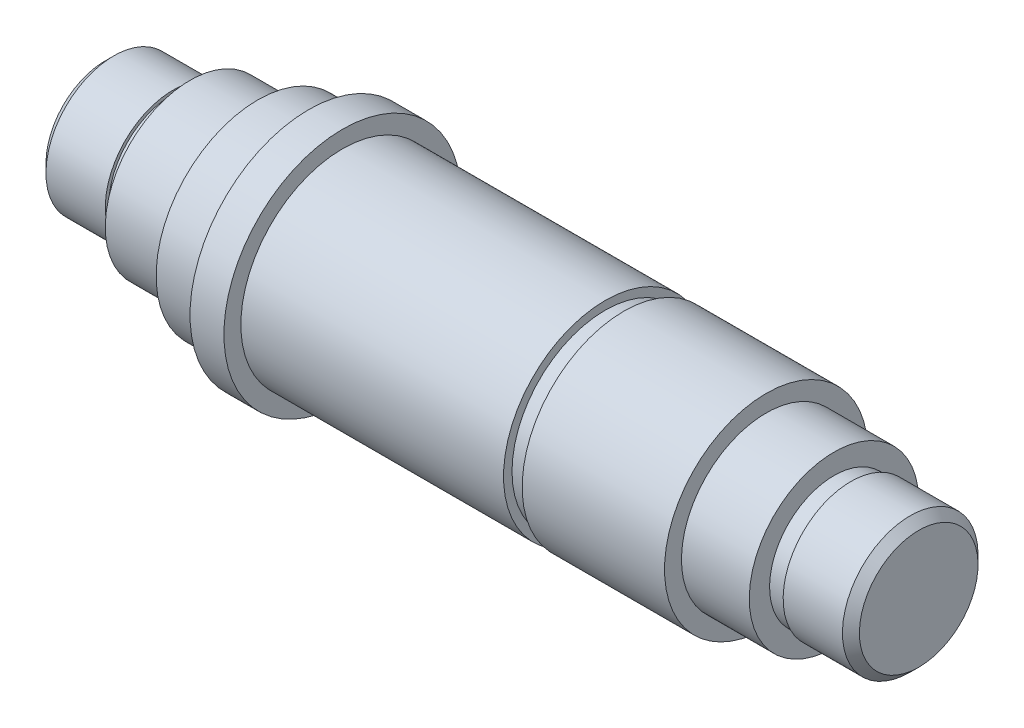
ISO-10303-21;
HEADER;
FILE_DESCRIPTION(('STEP AP214'),'2;1');
FILE_NAME('part.step','',(''),(''),'','','');
FILE_SCHEMA(('AUTOMOTIVE_DESIGN { 1 0 10303 214 1 1 1 1 }'));
ENDSEC;
DATA;
#1=APPLICATION_CONTEXT('core data for automotive mechanical design processes');
#2=APPLICATION_PROTOCOL_DEFINITION('international standard','automotive_design',2000,#1);
#3=PRODUCT_CONTEXT('',#1,'mechanical');
#4=PRODUCT('Part','Part','',(#3));
#5=PRODUCT_RELATED_PRODUCT_CATEGORY('part','',(#4));
#6=PRODUCT_DEFINITION_FORMATION('','',#4);
#7=PRODUCT_DEFINITION_CONTEXT('part definition',#1,'design');
#8=PRODUCT_DEFINITION('design','',#6,#7);
#9=PRODUCT_DEFINITION_SHAPE('','',#8);
#10=(LENGTH_UNIT() NAMED_UNIT(*) SI_UNIT(.MILLI.,.METRE.));
#11=(NAMED_UNIT(*) PLANE_ANGLE_UNIT() SI_UNIT($,.RADIAN.));
#12=(NAMED_UNIT(*) SI_UNIT($,.STERADIAN.) SOLID_ANGLE_UNIT());
#13=UNCERTAINTY_MEASURE_WITH_UNIT(LENGTH_MEASURE(1.E-05),#10,'distance_accuracy_value','');
#14=(GEOMETRIC_REPRESENTATION_CONTEXT(3) GLOBAL_UNCERTAINTY_ASSIGNED_CONTEXT((#13)) GLOBAL_UNIT_ASSIGNED_CONTEXT((#10,
#11,#12)) REPRESENTATION_CONTEXT('',''));
#15=CARTESIAN_POINT('',(0.,0.,0.));
#16=DIRECTION('',(0.,0.,1.));
#17=DIRECTION('',(1.,0.,0.));
#18=AXIS2_PLACEMENT_3D('',#15,#16,#17);
#19=CARTESIAN_POINT('',(-10.7643979057592,3.5,0.));
#20=DIRECTION('',(1.,0.,0.));
#21=DIRECTION('',(0.,1.,0.));
#22=AXIS2_PLACEMENT_3D('',#19,#20,#21);
#23=PLANE('',#22);
#24=CARTESIAN_POINT('',(-10.7643979057592,0.,0.));
#25=DIRECTION('',(-1.,0.,0.));
#26=DIRECTION('',(0.,-1.,0.));
#27=AXIS2_PLACEMENT_3D('',#24,#25,#26);
#28=CIRCLE('',#27,3.5);
#29=CARTESIAN_POINT('',(-10.7643979057592,-3.5,0.));
#30=VERTEX_POINT('',#29);
#31=EDGE_CURVE('E597',#30,#30,#28,.T.);
#32=ORIENTED_EDGE('',*,*,#31,.T.);
#33=EDGE_LOOP('',(#32));
#34=FACE_BOUND('',#33,.T.);
#35=ADVANCED_FACE('F521',(#34),#23,.F.);
#36=CARTESIAN_POINT('',(37.2356020942408,3.50000000000001,0.));
#37=DIRECTION('',(-1.,0.,0.));
#38=DIRECTION('',(0.,-1.,0.));
#39=AXIS2_PLACEMENT_3D('',#36,#37,#38);
#40=PLANE('',#39);
#41=CARTESIAN_POINT('',(37.2356020942408,0.,0.));
#42=DIRECTION('',(-1.,0.,0.));
#43=DIRECTION('',(0.,-1.,0.));
#44=AXIS2_PLACEMENT_3D('',#41,#42,#43);
#45=CIRCLE('',#44,3.50000000000001);
#46=CARTESIAN_POINT('',(37.2356020942408,-3.5,0.));
#47=VERTEX_POINT('',#46);
#48=EDGE_CURVE('E13',#47,#47,#45,.T.);
#49=ORIENTED_EDGE('',*,*,#48,.F.);
#50=EDGE_LOOP('',(#49));
#51=FACE_BOUND('',#50,.T.);
#52=ADVANCED_FACE('F735',(#51),#40,.F.);
#53=CARTESIAN_POINT('',(37.2356020942408,0.,0.));
#54=DIRECTION('',(-1.,0.,0.));
#55=DIRECTION('',(0.,-1.,0.));
#56=AXIS2_PLACEMENT_3D('',#53,#54,#55);
#57=CONICAL_SURFACE('',#56,3.50000000000001,0.785398163397445);
#58=CARTESIAN_POINT('',(36.7356020942408,0.,0.));
#59=DIRECTION('',(-1.,0.,0.));
#60=DIRECTION('',(0.,-1.,0.));
#61=AXIS2_PLACEMENT_3D('',#58,#59,#60);
#62=CIRCLE('',#61,4.);
#63=CARTESIAN_POINT('',(36.7356020942408,-4.,0.));
#64=VERTEX_POINT('',#63);
#65=EDGE_CURVE('E527',#64,#64,#62,.T.);
#66=ORIENTED_EDGE('',*,*,#65,.F.);
#67=EDGE_LOOP('',(#66));
#68=FACE_BOUND('',#67,.T.);
#69=ORIENTED_EDGE('',*,*,#48,.T.);
#70=EDGE_LOOP('',(#69));
#71=FACE_BOUND('',#70,.T.);
#72=ADVANCED_FACE('F730',(#68,#71),#57,.T.);
#73=CARTESIAN_POINT('',(-10.7643979057592,0.,0.));
#74=DIRECTION('',(-1.,0.,0.));
#75=DIRECTION('',(0.,-1.,0.));
#76=AXIS2_PLACEMENT_3D('',#73,#74,#75);
#77=CYLINDRICAL_SURFACE('',#76,4.);
#78=CARTESIAN_POINT('',(33.2356020942408,0.,0.));
#79=DIRECTION('',(-1.,0.,0.));
#80=DIRECTION('',(0.,-1.,0.));
#81=AXIS2_PLACEMENT_3D('',#78,#79,#80);
#82=CIRCLE('',#81,4.);
#83=CARTESIAN_POINT('',(33.2356020942408,-4.,0.));
#84=VERTEX_POINT('',#83);
#85=EDGE_CURVE('E531',#84,#84,#82,.T.);
#86=ORIENTED_EDGE('',*,*,#85,.F.);
#87=EDGE_LOOP('',(#86));
#88=FACE_BOUND('',#87,.T.);
#89=ORIENTED_EDGE('',*,*,#65,.T.);
#90=EDGE_LOOP('',(#89));
#91=FACE_BOUND('',#90,.T.);
#92=ADVANCED_FACE('F725',(#88,#91),#77,.T.);
#93=CARTESIAN_POINT('',(33.2356020942408,3.80000000000001,0.));
#94=DIRECTION('',(1.,0.,0.));
#95=DIRECTION('',(0.,1.,0.));
#96=AXIS2_PLACEMENT_3D('',#93,#94,#95);
#97=PLANE('',#96);
#98=CARTESIAN_POINT('',(33.2356020942408,0.,0.));
#99=DIRECTION('',(-1.,0.,0.));
#100=DIRECTION('',(0.,-1.,0.));
#101=AXIS2_PLACEMENT_3D('',#98,#99,#100);
#102=CIRCLE('',#101,3.8);
#103=CARTESIAN_POINT('',(33.2356020942408,-3.8,0.));
#104=VERTEX_POINT('',#103);
#105=EDGE_CURVE('E535',#104,#104,#102,.T.);
#106=ORIENTED_EDGE('',*,*,#105,.F.);
#107=EDGE_LOOP('',(#106));
#108=FACE_BOUND('',#107,.T.);
#109=ORIENTED_EDGE('',*,*,#85,.T.);
#110=EDGE_LOOP('',(#109));
#111=FACE_BOUND('',#110,.T.);
#112=ADVANCED_FACE('F719',(#108,#111),#97,.F.);
#113=CARTESIAN_POINT('',(-10.7643979057592,0.,0.));
#114=DIRECTION('',(-1.,0.,0.));
#115=DIRECTION('',(0.,-1.,0.));
#116=AXIS2_PLACEMENT_3D('',#113,#114,#115);
#117=CYLINDRICAL_SURFACE('',#116,3.8);
#118=CARTESIAN_POINT('',(32.2356020942408,0.,0.));
#119=DIRECTION('',(-1.,0.,0.));
#120=DIRECTION('',(0.,-1.,0.));
#121=AXIS2_PLACEMENT_3D('',#118,#119,#120);
#122=CIRCLE('',#121,3.8);
#123=CARTESIAN_POINT('',(32.2356020942408,-3.8,0.));
#124=VERTEX_POINT('',#123);
#125=EDGE_CURVE('E540',#124,#124,#122,.T.);
#126=ORIENTED_EDGE('',*,*,#125,.F.);
#127=EDGE_LOOP('',(#126));
#128=FACE_BOUND('',#127,.T.);
#129=ORIENTED_EDGE('',*,*,#105,.T.);
#130=EDGE_LOOP('',(#129));
#131=FACE_BOUND('',#130,.T.);
#132=ADVANCED_FACE('F713',(#128,#131),#117,.T.);
#133=CARTESIAN_POINT('',(32.2356020942408,5.00000000000001,0.));
#134=DIRECTION('',(-1.,0.,0.));
#135=DIRECTION('',(0.,-1.,0.));
#136=AXIS2_PLACEMENT_3D('',#133,#134,#135);
#137=PLANE('',#136);
#138=CARTESIAN_POINT('',(32.2356020942408,0.,0.));
#139=DIRECTION('',(-1.,0.,0.));
#140=DIRECTION('',(0.,-1.,0.));
#141=AXIS2_PLACEMENT_3D('',#138,#139,#140);
#142=CIRCLE('',#141,5.);
#143=CARTESIAN_POINT('',(32.2356020942408,-4.99999999999999,0.));
#144=VERTEX_POINT('',#143);
#145=EDGE_CURVE('E543',#144,#144,#142,.T.);
#146=ORIENTED_EDGE('',*,*,#145,.F.);
#147=EDGE_LOOP('',(#146));
#148=FACE_BOUND('',#147,.T.);
#149=ORIENTED_EDGE('',*,*,#125,.T.);
#150=EDGE_LOOP('',(#149));
#151=FACE_BOUND('',#150,.T.);
#152=ADVANCED_FACE('F707',(#148,#151),#137,.F.);
#153=CARTESIAN_POINT('',(-10.7643979057592,0.,0.));
#154=DIRECTION('',(-1.,0.,0.));
#155=DIRECTION('',(0.,-1.,0.));
#156=AXIS2_PLACEMENT_3D('',#153,#154,#155);
#157=CYLINDRICAL_SURFACE('',#156,5.);
#158=CARTESIAN_POINT('',(28.2356020942408,0.,0.));
#159=DIRECTION('',(-1.,0.,0.));
#160=DIRECTION('',(0.,-1.,0.));
#161=AXIS2_PLACEMENT_3D('',#158,#159,#160);
#162=CIRCLE('',#161,5.);
#163=CARTESIAN_POINT('',(28.2356020942408,-4.99999999999999,0.));
#164=VERTEX_POINT('',#163);
#165=EDGE_CURVE('E546',#164,#164,#162,.T.);
#166=ORIENTED_EDGE('',*,*,#165,.F.);
#167=EDGE_LOOP('',(#166));
#168=FACE_BOUND('',#167,.T.);
#169=ORIENTED_EDGE('',*,*,#145,.T.);
#170=EDGE_LOOP('',(#169));
#171=FACE_BOUND('',#170,.T.);
#172=ADVANCED_FACE('F701',(#168,#171),#157,.T.);
#173=CARTESIAN_POINT('',(28.2356020942408,6.,0.));
#174=DIRECTION('',(-1.,0.,0.));
#175=DIRECTION('',(0.,-1.,0.));
#176=AXIS2_PLACEMENT_3D('',#173,#174,#175);
#177=PLANE('',#176);
#178=CARTESIAN_POINT('',(28.2356020942408,0.,0.));
#179=DIRECTION('',(-1.,0.,0.));
#180=DIRECTION('',(0.,-1.,0.));
#181=AXIS2_PLACEMENT_3D('',#178,#179,#180);
#182=CIRCLE('',#181,6.);
#183=CARTESIAN_POINT('',(28.2356020942408,-5.99999999999999,0.));
#184=VERTEX_POINT('',#183);
#185=EDGE_CURVE('E549',#184,#184,#182,.T.);
#186=ORIENTED_EDGE('',*,*,#185,.F.);
#187=EDGE_LOOP('',(#186));
#188=FACE_BOUND('',#187,.T.);
#189=ORIENTED_EDGE('',*,*,#165,.T.);
#190=EDGE_LOOP('',(#189));
#191=FACE_BOUND('',#190,.T.);
#192=ADVANCED_FACE('F695',(#188,#191),#177,.F.);
#193=CARTESIAN_POINT('',(-10.7643979057592,0.,0.));
#194=DIRECTION('',(-1.,0.,0.));
#195=DIRECTION('',(0.,-1.,0.));
#196=AXIS2_PLACEMENT_3D('',#193,#194,#195);
#197=CYLINDRICAL_SURFACE('',#196,6.);
#198=CARTESIAN_POINT('',(19.8356020942409,0.,0.));
#199=DIRECTION('',(-1.,0.,0.));
#200=DIRECTION('',(0.,-1.,0.));
#201=AXIS2_PLACEMENT_3D('',#198,#199,#200);
#202=CIRCLE('',#201,6.);
#203=CARTESIAN_POINT('',(19.8356020942409,-5.99999999999999,0.));
#204=VERTEX_POINT('',#203);
#205=EDGE_CURVE('E552',#204,#204,#202,.T.);
#206=ORIENTED_EDGE('',*,*,#205,.F.);
#207=EDGE_LOOP('',(#206));
#208=FACE_BOUND('',#207,.T.);
#209=ORIENTED_EDGE('',*,*,#185,.T.);
#210=EDGE_LOOP('',(#209));
#211=FACE_BOUND('',#210,.T.);
#212=ADVANCED_FACE('F689',(#208,#211),#197,.T.);
#213=CARTESIAN_POINT('',(19.8356020942408,5.5,0.));
#214=DIRECTION('',(1.,0.,0.));
#215=DIRECTION('',(0.,1.,0.));
#216=AXIS2_PLACEMENT_3D('',#213,#214,#215);
#217=PLANE('',#216);
#218=CARTESIAN_POINT('',(19.8356020942409,0.,0.));
#219=DIRECTION('',(-1.,0.,0.));
#220=DIRECTION('',(0.,-1.,0.));
#221=AXIS2_PLACEMENT_3D('',#218,#219,#220);
#222=CIRCLE('',#221,5.5);
#223=CARTESIAN_POINT('',(19.8356020942409,-5.49999999999999,0.));
#224=VERTEX_POINT('',#223);
#225=EDGE_CURVE('E555',#224,#224,#222,.T.);
#226=ORIENTED_EDGE('',*,*,#225,.F.);
#227=EDGE_LOOP('',(#226));
#228=FACE_BOUND('',#227,.T.);
#229=ORIENTED_EDGE('',*,*,#205,.T.);
#230=EDGE_LOOP('',(#229));
#231=FACE_BOUND('',#230,.T.);
#232=ADVANCED_FACE('F683',(#228,#231),#217,.F.);
#233=CARTESIAN_POINT('',(-10.7643979057592,0.,0.));
#234=DIRECTION('',(-1.,0.,0.));
#235=DIRECTION('',(0.,-1.,0.));
#236=AXIS2_PLACEMENT_3D('',#233,#234,#235);
#237=CYLINDRICAL_SURFACE('',#236,5.5);
#238=CARTESIAN_POINT('',(18.7356020942408,0.,0.));
#239=DIRECTION('',(-1.,0.,0.));
#240=DIRECTION('',(0.,-1.,0.));
#241=AXIS2_PLACEMENT_3D('',#238,#239,#240);
#242=CIRCLE('',#241,5.5);
#243=CARTESIAN_POINT('',(18.7356020942408,-5.49999999999999,0.));
#244=VERTEX_POINT('',#243);
#245=EDGE_CURVE('E558',#244,#244,#242,.T.);
#246=ORIENTED_EDGE('',*,*,#245,.F.);
#247=EDGE_LOOP('',(#246));
#248=FACE_BOUND('',#247,.T.);
#249=ORIENTED_EDGE('',*,*,#225,.T.);
#250=EDGE_LOOP('',(#249));
#251=FACE_BOUND('',#250,.T.);
#252=ADVANCED_FACE('F677',(#248,#251),#237,.T.);
#253=CARTESIAN_POINT('',(18.7356020942408,6.,0.));
#254=DIRECTION('',(-1.,0.,0.));
#255=DIRECTION('',(0.,-1.,0.));
#256=AXIS2_PLACEMENT_3D('',#253,#254,#255);
#257=PLANE('',#256);
#258=CARTESIAN_POINT('',(18.7356020942408,0.,0.));
#259=DIRECTION('',(-1.,0.,0.));
#260=DIRECTION('',(0.,-1.,0.));
#261=AXIS2_PLACEMENT_3D('',#258,#259,#260);
#262=CIRCLE('',#261,6.);
#263=CARTESIAN_POINT('',(18.7356020942408,-5.99999999999999,0.));
#264=VERTEX_POINT('',#263);
#265=EDGE_CURVE('E561',#264,#264,#262,.T.);
#266=ORIENTED_EDGE('',*,*,#265,.F.);
#267=EDGE_LOOP('',(#266));
#268=FACE_BOUND('',#267,.T.);
#269=ORIENTED_EDGE('',*,*,#245,.T.);
#270=EDGE_LOOP('',(#269));
#271=FACE_BOUND('',#270,.T.);
#272=ADVANCED_FACE('F671',(#268,#271),#257,.F.);
#273=CARTESIAN_POINT('',(-10.7643979057592,0.,0.));
#274=DIRECTION('',(-1.,0.,0.));
#275=DIRECTION('',(0.,-1.,0.));
#276=AXIS2_PLACEMENT_3D('',#273,#274,#275);
#277=CYLINDRICAL_SURFACE('',#276,6.);
#278=CARTESIAN_POINT('',(3.23560209424085,0.,0.));
#279=DIRECTION('',(-1.,0.,0.));
#280=DIRECTION('',(0.,-1.,0.));
#281=AXIS2_PLACEMENT_3D('',#278,#279,#280);
#282=CIRCLE('',#281,6.);
#283=CARTESIAN_POINT('',(3.23560209424085,-6.,0.));
#284=VERTEX_POINT('',#283);
#285=EDGE_CURVE('E564',#284,#284,#282,.T.);
#286=ORIENTED_EDGE('',*,*,#285,.F.);
#287=EDGE_LOOP('',(#286));
#288=FACE_BOUND('',#287,.T.);
#289=ORIENTED_EDGE('',*,*,#265,.T.);
#290=EDGE_LOOP('',(#289));
#291=FACE_BOUND('',#290,.T.);
#292=ADVANCED_FACE('F665',(#288,#291),#277,.T.);
#293=CARTESIAN_POINT('',(3.23560209424085,7.,0.));
#294=DIRECTION('',(-1.,0.,0.));
#295=DIRECTION('',(0.,-1.,0.));
#296=AXIS2_PLACEMENT_3D('',#293,#294,#295);
#297=PLANE('',#296);
#298=CARTESIAN_POINT('',(3.23560209424085,0.,0.));
#299=DIRECTION('',(-1.,0.,0.));
#300=DIRECTION('',(0.,-1.,0.));
#301=AXIS2_PLACEMENT_3D('',#298,#299,#300);
#302=CIRCLE('',#301,7.);
#303=CARTESIAN_POINT('',(3.23560209424085,-7.,0.));
#304=VERTEX_POINT('',#303);
#305=EDGE_CURVE('E567',#304,#304,#302,.T.);
#306=ORIENTED_EDGE('',*,*,#305,.F.);
#307=EDGE_LOOP('',(#306));
#308=FACE_BOUND('',#307,.T.);
#309=ORIENTED_EDGE('',*,*,#285,.T.);
#310=EDGE_LOOP('',(#309));
#311=FACE_BOUND('',#310,.T.);
#312=ADVANCED_FACE('F659',(#308,#311),#297,.F.);
#313=CARTESIAN_POINT('',(-10.7643979057592,0.,0.));
#314=DIRECTION('',(-1.,0.,0.));
#315=DIRECTION('',(0.,-1.,0.));
#316=AXIS2_PLACEMENT_3D('',#313,#314,#315);
#317=CYLINDRICAL_SURFACE('',#316,7.);
#318=CARTESIAN_POINT('',(1.23560209424085,0.,0.));
#319=DIRECTION('',(-1.,0.,0.));
#320=DIRECTION('',(0.,-1.,0.));
#321=AXIS2_PLACEMENT_3D('',#318,#319,#320);
#322=CIRCLE('',#321,7.);
#323=CARTESIAN_POINT('',(1.23560209424085,-7.,0.));
#324=VERTEX_POINT('',#323);
#325=EDGE_CURVE('E570',#324,#324,#322,.T.);
#326=ORIENTED_EDGE('',*,*,#325,.F.);
#327=EDGE_LOOP('',(#326));
#328=FACE_BOUND('',#327,.T.);
#329=ORIENTED_EDGE('',*,*,#305,.T.);
#330=EDGE_LOOP('',(#329));
#331=FACE_BOUND('',#330,.T.);
#332=ADVANCED_FACE('F653',(#328,#331),#317,.T.);
#333=CARTESIAN_POINT('',(1.23560209424085,6.,0.));
#334=DIRECTION('',(1.,0.,0.));
#335=DIRECTION('',(0.,1.,0.));
#336=AXIS2_PLACEMENT_3D('',#333,#334,#335);
#337=PLANE('',#336);
#338=CARTESIAN_POINT('',(1.23560209424085,0.,0.));
#339=DIRECTION('',(-1.,0.,0.));
#340=DIRECTION('',(0.,-1.,0.));
#341=AXIS2_PLACEMENT_3D('',#338,#339,#340);
#342=CIRCLE('',#341,6.);
#343=CARTESIAN_POINT('',(1.23560209424085,-6.,0.));
#344=VERTEX_POINT('',#343);
#345=EDGE_CURVE('E573',#344,#344,#342,.T.);
#346=ORIENTED_EDGE('',*,*,#345,.F.);
#347=EDGE_LOOP('',(#346));
#348=FACE_BOUND('',#347,.T.);
#349=ORIENTED_EDGE('',*,*,#325,.T.);
#350=EDGE_LOOP('',(#349));
#351=FACE_BOUND('',#350,.T.);
#352=ADVANCED_FACE('F647',(#348,#351),#337,.F.);
#353=CARTESIAN_POINT('',(-10.7643979057592,0.,0.));
#354=DIRECTION('',(-1.,0.,0.));
#355=DIRECTION('',(0.,-1.,0.));
#356=AXIS2_PLACEMENT_3D('',#353,#354,#355);
#357=CYLINDRICAL_SURFACE('',#356,6.);
#358=CARTESIAN_POINT('',(-1.76439790575916,0.,0.));
#359=DIRECTION('',(-1.,0.,0.));
#360=DIRECTION('',(0.,-1.,0.));
#361=AXIS2_PLACEMENT_3D('',#358,#359,#360);
#362=CIRCLE('',#361,6.);
#363=CARTESIAN_POINT('',(-1.76439790575916,-6.,0.));
#364=VERTEX_POINT('',#363);
#365=EDGE_CURVE('E576',#364,#364,#362,.T.);
#366=ORIENTED_EDGE('',*,*,#365,.F.);
#367=EDGE_LOOP('',(#366));
#368=FACE_BOUND('',#367,.T.);
#369=ORIENTED_EDGE('',*,*,#345,.T.);
#370=EDGE_LOOP('',(#369));
#371=FACE_BOUND('',#370,.T.);
#372=ADVANCED_FACE('F641',(#368,#371),#357,.T.);
#373=CARTESIAN_POINT('',(-1.76439790575916,5.,0.));
#374=DIRECTION('',(1.,0.,0.));
#375=DIRECTION('',(0.,1.,0.));
#376=AXIS2_PLACEMENT_3D('',#373,#374,#375);
#377=PLANE('',#376);
#378=CARTESIAN_POINT('',(-1.76439790575916,0.,0.));
#379=DIRECTION('',(-1.,0.,0.));
#380=DIRECTION('',(0.,-1.,0.));
#381=AXIS2_PLACEMENT_3D('',#378,#379,#380);
#382=CIRCLE('',#381,5.);
#383=CARTESIAN_POINT('',(-1.76439790575916,-5.,0.));
#384=VERTEX_POINT('',#383);
#385=EDGE_CURVE('E579',#384,#384,#382,.T.);
#386=ORIENTED_EDGE('',*,*,#385,.F.);
#387=EDGE_LOOP('',(#386));
#388=FACE_BOUND('',#387,.T.);
#389=ORIENTED_EDGE('',*,*,#365,.T.);
#390=EDGE_LOOP('',(#389));
#391=FACE_BOUND('',#390,.T.);
#392=ADVANCED_FACE('F635',(#388,#391),#377,.F.);
#393=CARTESIAN_POINT('',(-10.7643979057592,0.,0.));
#394=DIRECTION('',(-1.,0.,0.));
#395=DIRECTION('',(0.,-1.,0.));
#396=AXIS2_PLACEMENT_3D('',#393,#394,#395);
#397=CYLINDRICAL_SURFACE('',#396,5.);
#398=CARTESIAN_POINT('',(-5.76439790575915,0.,0.));
#399=DIRECTION('',(-1.,0.,0.));
#400=DIRECTION('',(0.,-1.,0.));
#401=AXIS2_PLACEMENT_3D('',#398,#399,#400);
#402=CIRCLE('',#401,5.);
#403=CARTESIAN_POINT('',(-5.76439790575915,-5.,0.));
#404=VERTEX_POINT('',#403);
#405=EDGE_CURVE('E582',#404,#404,#402,.T.);
#406=ORIENTED_EDGE('',*,*,#405,.F.);
#407=EDGE_LOOP('',(#406));
#408=FACE_BOUND('',#407,.T.);
#409=ORIENTED_EDGE('',*,*,#385,.T.);
#410=EDGE_LOOP('',(#409));
#411=FACE_BOUND('',#410,.T.);
#412=ADVANCED_FACE('F629',(#408,#411),#397,.T.);
#413=CARTESIAN_POINT('',(-5.76439790575915,3.95,0.));
#414=DIRECTION('',(1.,0.,0.));
#415=DIRECTION('',(0.,1.,0.));
#416=AXIS2_PLACEMENT_3D('',#413,#414,#415);
#417=PLANE('',#416);
#418=CARTESIAN_POINT('',(-5.76439790575915,0.,0.));
#419=DIRECTION('',(-1.,0.,0.));
#420=DIRECTION('',(0.,-1.,0.));
#421=AXIS2_PLACEMENT_3D('',#418,#419,#420);
#422=CIRCLE('',#421,3.8);
#423=CARTESIAN_POINT('',(-5.76439790575915,-3.8,0.));
#424=VERTEX_POINT('',#423);
#425=EDGE_CURVE('E585',#424,#424,#422,.T.);
#426=ORIENTED_EDGE('',*,*,#425,.F.);
#427=EDGE_LOOP('',(#426));
#428=FACE_BOUND('',#427,.T.);
#429=ORIENTED_EDGE('',*,*,#405,.T.);
#430=EDGE_LOOP('',(#429));
#431=FACE_BOUND('',#430,.T.);
#432=ADVANCED_FACE('F623',(#428,#431),#417,.F.);
#433=CARTESIAN_POINT('',(-10.7643979057592,0.,0.));
#434=DIRECTION('',(-1.,0.,0.));
#435=DIRECTION('',(0.,-1.,0.));
#436=AXIS2_PLACEMENT_3D('',#433,#434,#435);
#437=CYLINDRICAL_SURFACE('',#436,3.8);
#438=CARTESIAN_POINT('',(-6.76439790575915,0.,0.));
#439=DIRECTION('',(-1.,0.,0.));
#440=DIRECTION('',(0.,-1.,0.));
#441=AXIS2_PLACEMENT_3D('',#438,#439,#440);
#442=CIRCLE('',#441,3.8);
#443=CARTESIAN_POINT('',(-6.76439790575915,-3.8,0.));
#444=VERTEX_POINT('',#443);
#445=EDGE_CURVE('E588',#444,#444,#442,.T.);
#446=ORIENTED_EDGE('',*,*,#445,.F.);
#447=EDGE_LOOP('',(#446));
#448=FACE_BOUND('',#447,.T.);
#449=ORIENTED_EDGE('',*,*,#425,.T.);
#450=EDGE_LOOP('',(#449));
#451=FACE_BOUND('',#450,.T.);
#452=ADVANCED_FACE('F617',(#448,#451),#437,.T.);
#453=CARTESIAN_POINT('',(-6.76439790575915,3.8,0.));
#454=DIRECTION('',(-1.,0.,0.));
#455=DIRECTION('',(0.,-1.,0.));
#456=AXIS2_PLACEMENT_3D('',#453,#454,#455);
#457=PLANE('',#456);
#458=CARTESIAN_POINT('',(-6.76439790575915,0.,0.));
#459=DIRECTION('',(-1.,0.,0.));
#460=DIRECTION('',(0.,-1.,0.));
#461=AXIS2_PLACEMENT_3D('',#458,#459,#460);
#462=CIRCLE('',#461,4.);
#463=CARTESIAN_POINT('',(-6.76439790575915,-4.,0.));
#464=VERTEX_POINT('',#463);
#465=EDGE_CURVE('E591',#464,#464,#462,.T.);
#466=ORIENTED_EDGE('',*,*,#465,.F.);
#467=EDGE_LOOP('',(#466));
#468=FACE_BOUND('',#467,.T.);
#469=ORIENTED_EDGE('',*,*,#445,.T.);
#470=EDGE_LOOP('',(#469));
#471=FACE_BOUND('',#470,.T.);
#472=ADVANCED_FACE('F611',(#468,#471),#457,.F.);
#473=CARTESIAN_POINT('',(-10.7643979057592,0.,0.));
#474=DIRECTION('',(-1.,0.,0.));
#475=DIRECTION('',(0.,-1.,0.));
#476=AXIS2_PLACEMENT_3D('',#473,#474,#475);
#477=CYLINDRICAL_SURFACE('',#476,4.);
#478=CARTESIAN_POINT('',(-10.2643979057592,0.,0.));
#479=DIRECTION('',(-1.,0.,0.));
#480=DIRECTION('',(0.,-1.,0.));
#481=AXIS2_PLACEMENT_3D('',#478,#479,#480);
#482=CIRCLE('',#481,4.);
#483=CARTESIAN_POINT('',(-10.2643979057592,-4.,0.));
#484=VERTEX_POINT('',#483);
#485=EDGE_CURVE('E594',#484,#484,#482,.T.);
#486=ORIENTED_EDGE('',*,*,#485,.F.);
#487=EDGE_LOOP('',(#486));
#488=FACE_BOUND('',#487,.T.);
#489=ORIENTED_EDGE('',*,*,#465,.T.);
#490=EDGE_LOOP('',(#489));
#491=FACE_BOUND('',#490,.T.);
#492=ADVANCED_FACE('F605',(#488,#491),#477,.T.);
#493=CARTESIAN_POINT('',(-10.2643979057592,0.,0.));
#494=DIRECTION('',(1.,0.,0.));
#495=DIRECTION('',(0.,1.,0.));
#496=AXIS2_PLACEMENT_3D('',#493,#494,#495);
#497=CONICAL_SURFACE('',#496,4.,0.785398163397446);
#498=ORIENTED_EDGE('',*,*,#31,.F.);
#499=EDGE_LOOP('',(#498));
#500=FACE_BOUND('',#499,.T.);
#501=ORIENTED_EDGE('',*,*,#485,.T.);
#502=EDGE_LOOP('',(#501));
#503=FACE_BOUND('',#502,.T.);
#504=ADVANCED_FACE('F602',(#500,#503),#497,.T.);
#505=CLOSED_SHELL('',(#35,#52,#72,#92,#112,#132,#152,#172,#192,#212,#232,#252,#272,#292,#312,
#332,#352,#372,#392,#412,#432,#452,#472,#492,#504));
#506=MANIFOLD_SOLID_BREP('B2',#505);
#507=ADVANCED_BREP_SHAPE_REPRESENTATION('',(#18,#506),#14);
#508=SHAPE_DEFINITION_REPRESENTATION(#9,#507);
ENDSEC;
END-ISO-10303-21;
